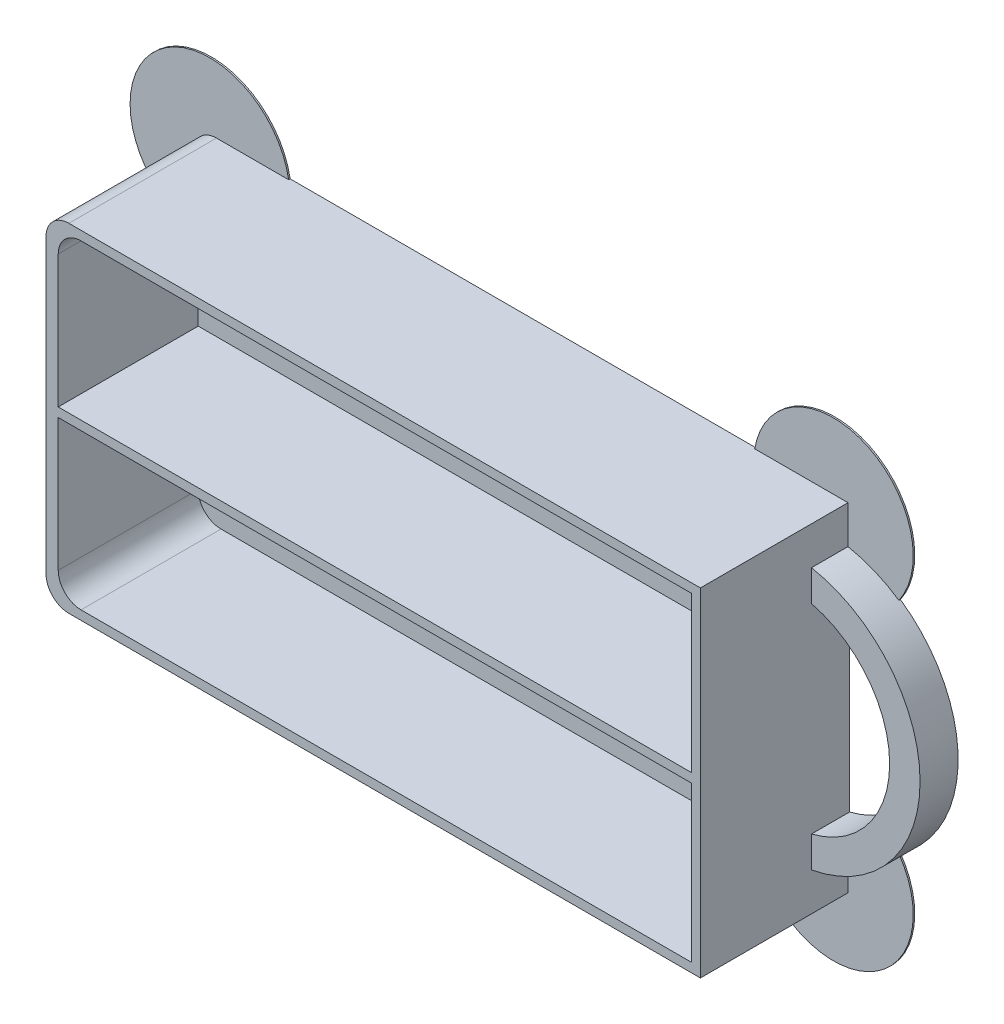
ISO-10303-21;
HEADER;
FILE_DESCRIPTION(('STEP AP214'),'2;1');
FILE_NAME('part.step','',(''),(''),'','','');
FILE_SCHEMA(('AUTOMOTIVE_DESIGN { 1 0 10303 214 1 1 1 1 }'));
ENDSEC;
DATA;
#1=APPLICATION_CONTEXT('core data for automotive mechanical design processes');
#2=APPLICATION_PROTOCOL_DEFINITION('international standard','automotive_design',2000,#1);
#3=PRODUCT_CONTEXT('',#1,'mechanical');
#4=PRODUCT('Part','Part','',(#3));
#5=PRODUCT_RELATED_PRODUCT_CATEGORY('part','',(#4));
#6=PRODUCT_DEFINITION_FORMATION('','',#4);
#7=PRODUCT_DEFINITION_CONTEXT('part definition',#1,'design');
#8=PRODUCT_DEFINITION('design','',#6,#7);
#9=PRODUCT_DEFINITION_SHAPE('','',#8);
#10=(LENGTH_UNIT() NAMED_UNIT(*) SI_UNIT(.MILLI.,.METRE.));
#11=(NAMED_UNIT(*) PLANE_ANGLE_UNIT() SI_UNIT($,.RADIAN.));
#12=(NAMED_UNIT(*) SI_UNIT($,.STERADIAN.) SOLID_ANGLE_UNIT());
#13=UNCERTAINTY_MEASURE_WITH_UNIT(LENGTH_MEASURE(1.E-05),#10,'distance_accuracy_value','');
#14=(GEOMETRIC_REPRESENTATION_CONTEXT(3) GLOBAL_UNCERTAINTY_ASSIGNED_CONTEXT((#13)) GLOBAL_UNIT_ASSIGNED_CONTEXT((#10,
#11,#12)) REPRESENTATION_CONTEXT('',''));
#15=CARTESIAN_POINT('',(0.,0.,0.));
#16=DIRECTION('',(0.,0.,1.));
#17=DIRECTION('',(1.,0.,0.));
#18=AXIS2_PLACEMENT_3D('',#15,#16,#17);
#19=CARTESIAN_POINT('',(-40.,-19.2,19.6));
#20=DIRECTION('',(0.,0.,-1.));
#21=DIRECTION('',(-1.,0.,0.));
#22=AXIS2_PLACEMENT_3D('',#19,#20,#21);
#23=CYLINDRICAL_SURFACE('',#22,3.);
#24=DIRECTION('',(0.,0.,-1.));
#25=VECTOR('',#24,1.);
#26=CARTESIAN_POINT('',(-43.,-19.2,19.6));
#27=LINE('',#26,#25);
#28=CARTESIAN_POINT('',(-43.,-19.2,0.199999999999999));
#29=VERTEX_POINT('',#28);
#30=CARTESIAN_POINT('',(-43.,-19.2,19.6));
#31=VERTEX_POINT('',#30);
#32=EDGE_CURVE('E408',#29,#31,#27,.F.);
#33=ORIENTED_EDGE('',*,*,#32,.F.);
#34=CARTESIAN_POINT('',(-40.,-19.2,0.199999999999999));
#35=DIRECTION('',(0.,0.,-1.));
#36=DIRECTION('',(-1.,0.,0.));
#37=AXIS2_PLACEMENT_3D('',#34,#35,#36);
#38=CIRCLE('',#37,3.);
#39=CARTESIAN_POINT('',(-40.,-22.2,0.199999999999999));
#40=VERTEX_POINT('',#39);
#41=EDGE_CURVE('E49',#29,#40,#38,.F.);
#42=ORIENTED_EDGE('',*,*,#41,.T.);
#43=DIRECTION('',(0.,0.,-1.));
#44=VECTOR('',#43,1.);
#45=CARTESIAN_POINT('',(-40.,-22.2,19.6));
#46=LINE('',#45,#44);
#47=CARTESIAN_POINT('',(-40.,-22.2,19.6));
#48=VERTEX_POINT('',#47);
#49=EDGE_CURVE('E419',#48,#40,#46,.T.);
#50=ORIENTED_EDGE('',*,*,#49,.F.);
#51=CARTESIAN_POINT('',(-40.,-19.2,19.6));
#52=DIRECTION('',(0.,0.,1.));
#53=DIRECTION('',(1.,0.,0.));
#54=AXIS2_PLACEMENT_3D('',#51,#52,#53);
#55=CIRCLE('',#54,3.);
#56=EDGE_CURVE('E415',#31,#48,#55,.T.);
#57=ORIENTED_EDGE('',*,*,#56,.F.);
#58=EDGE_LOOP('',(#33,#42,#50,#57));
#59=FACE_BOUND('',#58,.T.);
#60=ADVANCED_FACE('F41',(#59),#23,.T.);
#61=CARTESIAN_POINT('',(43.,22.2,19.6));
#62=DIRECTION('',(-1.,0.,0.));
#63=DIRECTION('',(0.,-1.,0.));
#64=AXIS2_PLACEMENT_3D('',#61,#62,#63);
#65=PLANE('',#64);
#66=DIRECTION('',(0.,0.,-1.));
#67=VECTOR('',#66,1.);
#68=CARTESIAN_POINT('',(43.,-22.2,19.6));
#69=LINE('',#68,#67);
#70=CARTESIAN_POINT('',(43.,-22.2,19.6));
#71=VERTEX_POINT('',#70);
#72=CARTESIAN_POINT('',(43.,-22.2,0.199999999999999));
#73=VERTEX_POINT('',#72);
#74=EDGE_CURVE('E395',#71,#73,#69,.T.);
#75=ORIENTED_EDGE('',*,*,#74,.T.);
#76=DIRECTION('',(0.,1.,0.));
#77=VECTOR('',#76,1.);
#78=CARTESIAN_POINT('',(43.,22.2,0.199999999999999));
#79=LINE('',#78,#77);
#80=CARTESIAN_POINT('',(43.,-17.2,0.2));
#81=VERTEX_POINT('',#80);
#82=EDGE_CURVE('E249',#73,#81,#79,.T.);
#83=ORIENTED_EDGE('',*,*,#82,.T.);
#84=DIRECTION('',(0.,0.,-1.));
#85=VECTOR('',#84,1.);
#86=CARTESIAN_POINT('',(43.,-17.2,5.));
#87=LINE('',#86,#85);
#88=CARTESIAN_POINT('',(43.,-17.2,5.));
#89=VERTEX_POINT('',#88);
#90=EDGE_CURVE('E368',#89,#81,#87,.T.);
#91=ORIENTED_EDGE('',*,*,#90,.F.);
#92=DIRECTION('',(0.,-1.,0.));
#93=VECTOR('',#92,1.);
#94=CARTESIAN_POINT('',(43.,-17.2,5.));
#95=LINE('',#94,#93);
#96=CARTESIAN_POINT('',(43.,-13.1087756865391,5.));
#97=VERTEX_POINT('',#96);
#98=EDGE_CURVE('E366',#97,#89,#95,.T.);
#99=ORIENTED_EDGE('',*,*,#98,.F.);
#100=DIRECTION('',(0.,0.,-1.));
#101=VECTOR('',#100,1.);
#102=CARTESIAN_POINT('',(43.,-13.1087756865391,5.));
#103=LINE('',#102,#101);
#104=CARTESIAN_POINT('',(43.,-13.1087756865391,0.));
#105=VERTEX_POINT('',#104);
#106=EDGE_CURVE('E373',#97,#105,#103,.T.);
#107=ORIENTED_EDGE('',*,*,#106,.T.);
#108=DIRECTION('',(0.,1.,0.));
#109=VECTOR('',#108,1.);
#110=CARTESIAN_POINT('',(43.,22.2,0.));
#111=LINE('',#110,#109);
#112=CARTESIAN_POINT('',(43.,13.1087756865391,0.));
#113=VERTEX_POINT('',#112);
#114=EDGE_CURVE('E382',#105,#113,#111,.T.);
#115=ORIENTED_EDGE('',*,*,#114,.T.);
#116=DIRECTION('',(0.,0.,-1.));
#117=VECTOR('',#116,1.);
#118=CARTESIAN_POINT('',(43.,13.1087756865391,5.));
#119=LINE('',#118,#117);
#120=CARTESIAN_POINT('',(43.,13.1087756865391,5.));
#121=VERTEX_POINT('',#120);
#122=EDGE_CURVE('E376',#121,#113,#119,.T.);
#123=ORIENTED_EDGE('',*,*,#122,.F.);
#124=DIRECTION('',(0.,-1.,0.));
#125=VECTOR('',#124,1.);
#126=CARTESIAN_POINT('',(43.,17.2,5.));
#127=LINE('',#126,#125);
#128=CARTESIAN_POINT('',(43.,17.2,5.));
#129=VERTEX_POINT('',#128);
#130=EDGE_CURVE('E360',#129,#121,#127,.T.);
#131=ORIENTED_EDGE('',*,*,#130,.F.);
#132=DIRECTION('',(0.,0.,-1.));
#133=VECTOR('',#132,1.);
#134=CARTESIAN_POINT('',(43.,17.2,5.));
#135=LINE('',#134,#133);
#136=CARTESIAN_POINT('',(43.,17.2,0.2));
#137=VERTEX_POINT('',#136);
#138=EDGE_CURVE('E379',#129,#137,#135,.T.);
#139=ORIENTED_EDGE('',*,*,#138,.T.);
#140=DIRECTION('',(0.,-1.,0.));
#141=VECTOR('',#140,1.);
#142=CARTESIAN_POINT('',(43.,22.2,0.199999999999999));
#143=LINE('',#142,#141);
#144=CARTESIAN_POINT('',(43.,22.2,0.199999999999999));
#145=VERTEX_POINT('',#144);
#146=EDGE_CURVE('E296',#145,#137,#143,.T.);
#147=ORIENTED_EDGE('',*,*,#146,.F.);
#148=DIRECTION('',(0.,0.,-1.));
#149=VECTOR('',#148,1.);
#150=CARTESIAN_POINT('',(43.,22.2,19.6));
#151=LINE('',#150,#149);
#152=CARTESIAN_POINT('',(43.,22.2,19.6));
#153=VERTEX_POINT('',#152);
#154=EDGE_CURVE('E405',#153,#145,#151,.T.);
#155=ORIENTED_EDGE('',*,*,#154,.F.);
#156=DIRECTION('',(0.,1.,0.));
#157=VECTOR('',#156,1.);
#158=CARTESIAN_POINT('',(43.,22.2,19.6));
#159=LINE('',#158,#157);
#160=EDGE_CURVE('E383',#71,#153,#159,.T.);
#161=ORIENTED_EDGE('',*,*,#160,.F.);
#162=EDGE_LOOP('',(#75,#83,#91,#99,#107,#115,#123,#131,#139,#147,#155,#161));
#163=FACE_BOUND('',#162,.T.);
#164=ADVANCED_FACE('F490',(#163),#65,.F.);
#165=CARTESIAN_POINT('',(-43.,22.2,19.6));
#166=DIRECTION('',(0.,-1.,0.));
#167=DIRECTION('',(0.,0.,-1.));
#168=AXIS2_PLACEMENT_3D('',#165,#166,#167);
#169=PLANE('',#168);
#170=DIRECTION('',(-1.,0.,0.));
#171=VECTOR('',#170,1.);
#172=CARTESIAN_POINT('',(-43.,22.2,0.));
#173=LINE('',#172,#171);
#174=CARTESIAN_POINT('',(30.736733343293,22.2,0.));
#175=VERTEX_POINT('',#174);
#176=CARTESIAN_POINT('',(-30.5170952229311,22.2,0.));
#177=VERTEX_POINT('',#176);
#178=EDGE_CURVE('E397',#175,#177,#173,.T.);
#179=ORIENTED_EDGE('',*,*,#178,.T.);
#180=DIRECTION('',(0.,0.,-1.));
#181=VECTOR('',#180,1.);
#182=CARTESIAN_POINT('',(-30.5170952229311,22.2,0.2));
#183=LINE('',#182,#181);
#184=CARTESIAN_POINT('',(-30.5170952229311,22.2,0.2));
#185=VERTEX_POINT('',#184);
#186=EDGE_CURVE('E273',#185,#177,#183,.T.);
#187=ORIENTED_EDGE('',*,*,#186,.F.);
#188=DIRECTION('',(-1.,0.,0.));
#189=VECTOR('',#188,1.);
#190=CARTESIAN_POINT('',(-43.,22.2,0.199999999999999));
#191=LINE('',#190,#189);
#192=CARTESIAN_POINT('',(-40.,22.2,0.199999999999999));
#193=VERTEX_POINT('',#192);
#194=EDGE_CURVE('E286',#185,#193,#191,.T.);
#195=ORIENTED_EDGE('',*,*,#194,.T.);
#196=DIRECTION('',(0.,0.,-1.));
#197=VECTOR('',#196,1.);
#198=CARTESIAN_POINT('',(-40.,22.2,19.6));
#199=LINE('',#198,#197);
#200=CARTESIAN_POINT('',(-40.,22.2,19.6));
#201=VERTEX_POINT('',#200);
#202=EDGE_CURVE('E413',#193,#201,#199,.F.);
#203=ORIENTED_EDGE('',*,*,#202,.T.);
#204=DIRECTION('',(-1.,0.,0.));
#205=VECTOR('',#204,1.);
#206=CARTESIAN_POINT('',(-43.,22.2,19.6));
#207=LINE('',#206,#205);
#208=EDGE_CURVE('E386',#153,#201,#207,.T.);
#209=ORIENTED_EDGE('',*,*,#208,.F.);
#210=ORIENTED_EDGE('',*,*,#154,.T.);
#211=DIRECTION('',(1.,0.,0.));
#212=VECTOR('',#211,1.);
#213=CARTESIAN_POINT('',(-43.,22.2,0.199999999999999));
#214=LINE('',#213,#212);
#215=CARTESIAN_POINT('',(30.7367333432933,22.2,0.199999999999999));
#216=VERTEX_POINT('',#215);
#217=EDGE_CURVE('E300',#216,#145,#214,.T.);
#218=ORIENTED_EDGE('',*,*,#217,.F.);
#219=DIRECTION('',(0.,0.,-1.));
#220=VECTOR('',#219,1.);
#221=CARTESIAN_POINT('',(30.7367333432933,22.2,0.2));
#222=LINE('',#221,#220);
#223=EDGE_CURVE('E294',#216,#175,#222,.T.);
#224=ORIENTED_EDGE('',*,*,#223,.T.);
#225=EDGE_LOOP('',(#179,#187,#195,#203,#209,#210,#218,#224));
#226=FACE_BOUND('',#225,.T.);
#227=ADVANCED_FACE('F472',(#226),#169,.F.);
#228=CARTESIAN_POINT('',(-43.,22.2,19.6));
#229=DIRECTION('',(1.,0.,0.));
#230=DIRECTION('',(0.,1.,0.));
#231=AXIS2_PLACEMENT_3D('',#228,#229,#230);
#232=PLANE('',#231);
#233=DIRECTION('',(0.,-1.,0.));
#234=VECTOR('',#233,1.);
#235=CARTESIAN_POINT('',(-43.,22.2,0.));
#236=LINE('',#235,#234);
#237=CARTESIAN_POINT('',(-43.,10.1447680585788,0.));
#238=VERTEX_POINT('',#237);
#239=CARTESIAN_POINT('',(-43.,-10.1447680585788,0.));
#240=VERTEX_POINT('',#239);
#241=EDGE_CURVE('E400',#238,#240,#236,.T.);
#242=ORIENTED_EDGE('',*,*,#241,.T.);
#243=DIRECTION('',(0.,0.,-1.));
#244=VECTOR('',#243,1.);
#245=CARTESIAN_POINT('',(-43.,-10.1447680585788,0.2));
#246=LINE('',#245,#244);
#247=CARTESIAN_POINT('',(-43.,-10.1447680585788,0.2));
#248=VERTEX_POINT('',#247);
#249=EDGE_CURVE('E258',#248,#240,#246,.T.);
#250=ORIENTED_EDGE('',*,*,#249,.F.);
#251=DIRECTION('',(0.,1.,0.));
#252=VECTOR('',#251,1.);
#253=CARTESIAN_POINT('',(-43.,22.2,0.199999999999999));
#254=LINE('',#253,#252);
#255=EDGE_CURVE('E270',#29,#248,#254,.T.);
#256=ORIENTED_EDGE('',*,*,#255,.F.);
#257=ORIENTED_EDGE('',*,*,#32,.T.);
#258=DIRECTION('',(0.,-1.,0.));
#259=VECTOR('',#258,1.);
#260=CARTESIAN_POINT('',(-43.,22.2,19.6));
#261=LINE('',#260,#259);
#262=CARTESIAN_POINT('',(-43.,19.2,19.6));
#263=VERTEX_POINT('',#262);
#264=EDGE_CURVE('E390',#263,#31,#261,.T.);
#265=ORIENTED_EDGE('',*,*,#264,.F.);
#266=DIRECTION('',(0.,0.,-1.));
#267=VECTOR('',#266,1.);
#268=CARTESIAN_POINT('',(-43.,19.2,19.6));
#269=LINE('',#268,#267);
#270=CARTESIAN_POINT('',(-43.,19.2,0.199999999999999));
#271=VERTEX_POINT('',#270);
#272=EDGE_CURVE('E410',#263,#271,#269,.T.);
#273=ORIENTED_EDGE('',*,*,#272,.T.);
#274=DIRECTION('',(0.,-1.,0.));
#275=VECTOR('',#274,1.);
#276=CARTESIAN_POINT('',(-43.,22.2,0.199999999999999));
#277=LINE('',#276,#275);
#278=CARTESIAN_POINT('',(-43.,10.1447680585788,0.2));
#279=VERTEX_POINT('',#278);
#280=EDGE_CURVE('E281',#271,#279,#277,.T.);
#281=ORIENTED_EDGE('',*,*,#280,.T.);
#282=DIRECTION('',(0.,0.,-1.));
#283=VECTOR('',#282,1.);
#284=CARTESIAN_POINT('',(-43.,10.1447680585788,0.2));
#285=LINE('',#284,#283);
#286=EDGE_CURVE('E272',#279,#238,#285,.T.);
#287=ORIENTED_EDGE('',*,*,#286,.T.);
#288=EDGE_LOOP('',(#242,#250,#256,#257,#265,#273,#281,#287));
#289=FACE_BOUND('',#288,.T.);
#290=ADVANCED_FACE('F462',(#289),#232,.F.);
#291=CARTESIAN_POINT('',(-43.,-22.2,19.6));
#292=DIRECTION('',(0.,1.,0.));
#293=DIRECTION('',(0.,0.,1.));
#294=AXIS2_PLACEMENT_3D('',#291,#292,#293);
#295=PLANE('',#294);
#296=DIRECTION('',(1.,0.,0.));
#297=VECTOR('',#296,1.);
#298=CARTESIAN_POINT('',(-43.,-22.2,0.));
#299=LINE('',#298,#297);
#300=CARTESIAN_POINT('',(-30.5170952229311,-22.2,0.));
#301=VERTEX_POINT('',#300);
#302=CARTESIAN_POINT('',(30.7367333432931,-22.2,0.));
#303=VERTEX_POINT('',#302);
#304=EDGE_CURVE('E387',#301,#303,#299,.T.);
#305=ORIENTED_EDGE('',*,*,#304,.T.);
#306=DIRECTION('',(0.,0.,-1.));
#307=VECTOR('',#306,1.);
#308=CARTESIAN_POINT('',(30.7367333432933,-22.2,0.2));
#309=LINE('',#308,#307);
#310=CARTESIAN_POINT('',(30.7367333432933,-22.2,0.199999999999999));
#311=VERTEX_POINT('',#310);
#312=EDGE_CURVE('E56',#311,#303,#309,.T.);
#313=ORIENTED_EDGE('',*,*,#312,.F.);
#314=DIRECTION('',(1.,0.,0.));
#315=VECTOR('',#314,1.);
#316=CARTESIAN_POINT('',(-43.,-22.2,0.199999999999999));
#317=LINE('',#316,#315);
#318=EDGE_CURVE('E60',#311,#73,#317,.T.);
#319=ORIENTED_EDGE('',*,*,#318,.T.);
#320=ORIENTED_EDGE('',*,*,#74,.F.);
#321=DIRECTION('',(1.,0.,0.));
#322=VECTOR('',#321,1.);
#323=CARTESIAN_POINT('',(-43.,-22.2,19.6));
#324=LINE('',#323,#322);
#325=EDGE_CURVE('E393',#48,#71,#324,.T.);
#326=ORIENTED_EDGE('',*,*,#325,.F.);
#327=ORIENTED_EDGE('',*,*,#49,.T.);
#328=DIRECTION('',(-1.,0.,0.));
#329=VECTOR('',#328,1.);
#330=CARTESIAN_POINT('',(-43.,-22.2,0.199999999999999));
#331=LINE('',#330,#329);
#332=CARTESIAN_POINT('',(-30.5170952229311,-22.2,0.2));
#333=VERTEX_POINT('',#332);
#334=EDGE_CURVE('E266',#333,#40,#331,.T.);
#335=ORIENTED_EDGE('',*,*,#334,.F.);
#336=DIRECTION('',(0.,0.,-1.));
#337=VECTOR('',#336,1.);
#338=CARTESIAN_POINT('',(-30.5170952229311,-22.2,0.2));
#339=LINE('',#338,#337);
#340=EDGE_CURVE('E257',#333,#301,#339,.T.);
#341=ORIENTED_EDGE('',*,*,#340,.T.);
#342=EDGE_LOOP('',(#305,#313,#319,#320,#326,#327,#335,#341));
#343=FACE_BOUND('',#342,.T.);
#344=ADVANCED_FACE('F453',(#343),#295,.F.);
#345=CARTESIAN_POINT('',(0.,0.,19.6));
#346=DIRECTION('',(0.,0.,1.));
#347=DIRECTION('',(1.,0.,0.));
#348=AXIS2_PLACEMENT_3D('',#345,#346,#347);
#349=PLANE('',#348);
#350=DIRECTION('',(-1.,0.,0.));
#351=VECTOR('',#350,1.);
#352=CARTESIAN_POINT('',(0.,21.,19.6));
#353=LINE('',#352,#351);
#354=CARTESIAN_POINT('',(41.8,21.,19.6));
#355=VERTEX_POINT('',#354);
#356=CARTESIAN_POINT('',(-38.4,21.,19.6));
#357=VERTEX_POINT('',#356);
#358=EDGE_CURVE('E312',#355,#357,#353,.T.);
#359=ORIENTED_EDGE('',*,*,#358,.F.);
#360=DIRECTION('',(0.,1.,0.));
#361=VECTOR('',#360,1.);
#362=CARTESIAN_POINT('',(41.8,0.,19.6));
#363=LINE('',#362,#361);
#364=CARTESIAN_POINT('',(41.8,0.597115384615389,19.6));
#365=VERTEX_POINT('',#364);
#366=EDGE_CURVE('E321',#365,#355,#363,.T.);
#367=ORIENTED_EDGE('',*,*,#366,.F.);
#368=DIRECTION('',(-1.,0.,0.));
#369=VECTOR('',#368,1.);
#370=CARTESIAN_POINT('',(0.,0.597115384615384,19.6));
#371=LINE('',#370,#369);
#372=CARTESIAN_POINT('',(-41.4,0.597115384615379,19.6));
#373=VERTEX_POINT('',#372);
#374=EDGE_CURVE('E318',#365,#373,#371,.T.);
#375=ORIENTED_EDGE('',*,*,#374,.T.);
#376=DIRECTION('',(0.,-1.,0.));
#377=VECTOR('',#376,1.);
#378=CARTESIAN_POINT('',(-41.4,0.,19.6));
#379=LINE('',#378,#377);
#380=CARTESIAN_POINT('',(-41.4,18.,19.6));
#381=VERTEX_POINT('',#380);
#382=EDGE_CURVE('E315',#381,#373,#379,.T.);
#383=ORIENTED_EDGE('',*,*,#382,.F.);
#384=CARTESIAN_POINT('',(-38.4,18.,19.6));
#385=DIRECTION('',(0.,0.,1.));
#386=DIRECTION('',(1.,0.,0.));
#387=AXIS2_PLACEMENT_3D('',#384,#385,#386);
#388=CIRCLE('',#387,3.);
#389=EDGE_CURVE('E438',#381,#357,#388,.F.);
#390=ORIENTED_EDGE('',*,*,#389,.T.);
#391=EDGE_LOOP('',(#359,#367,#375,#383,#390));
#392=FACE_BOUND('',#391,.T.);
#393=DIRECTION('',(-1.,0.,0.));
#394=VECTOR('',#393,1.);
#395=CARTESIAN_POINT('',(0.,-0.602884615384616,19.6));
#396=LINE('',#395,#394);
#397=CARTESIAN_POINT('',(41.8,-0.60288461538461,19.6));
#398=VERTEX_POINT('',#397);
#399=CARTESIAN_POINT('',(-41.4,-0.602884615384621,19.6));
#400=VERTEX_POINT('',#399);
#401=EDGE_CURVE('E303',#398,#400,#396,.T.);
#402=ORIENTED_EDGE('',*,*,#401,.F.);
#403=DIRECTION('',(0.,1.,0.));
#404=VECTOR('',#403,1.);
#405=CARTESIAN_POINT('',(41.8,0.,19.6));
#406=LINE('',#405,#404);
#407=CARTESIAN_POINT('',(41.8,-21.,19.6));
#408=VERTEX_POINT('',#407);
#409=EDGE_CURVE('E346',#408,#398,#406,.T.);
#410=ORIENTED_EDGE('',*,*,#409,.F.);
#411=DIRECTION('',(1.,0.,0.));
#412=VECTOR('',#411,1.);
#413=CARTESIAN_POINT('',(0.,-21.,19.6));
#414=LINE('',#413,#412);
#415=CARTESIAN_POINT('',(-38.4,-21.,19.6));
#416=VERTEX_POINT('',#415);
#417=EDGE_CURVE('E344',#416,#408,#414,.T.);
#418=ORIENTED_EDGE('',*,*,#417,.F.);
#419=CARTESIAN_POINT('',(-38.4,-18.,19.6));
#420=DIRECTION('',(0.,0.,1.));
#421=DIRECTION('',(1.,0.,0.));
#422=AXIS2_PLACEMENT_3D('',#419,#420,#421);
#423=CIRCLE('',#422,3.);
#424=CARTESIAN_POINT('',(-41.4,-18.,19.6));
#425=VERTEX_POINT('',#424);
#426=EDGE_CURVE('E436',#416,#425,#423,.F.);
#427=ORIENTED_EDGE('',*,*,#426,.T.);
#428=DIRECTION('',(0.,-1.,0.));
#429=VECTOR('',#428,1.);
#430=CARTESIAN_POINT('',(-41.4,0.,19.6));
#431=LINE('',#430,#429);
#432=EDGE_CURVE('E341',#400,#425,#431,.T.);
#433=ORIENTED_EDGE('',*,*,#432,.F.);
#434=EDGE_LOOP('',(#402,#410,#418,#427,#433));
#435=FACE_BOUND('',#434,.T.);
#436=ORIENTED_EDGE('',*,*,#208,.T.);
#437=CARTESIAN_POINT('',(-40.,19.2,19.6));
#438=DIRECTION('',(0.,0.,1.));
#439=DIRECTION('',(1.,0.,0.));
#440=AXIS2_PLACEMENT_3D('',#437,#438,#439);
#441=CIRCLE('',#440,3.);
#442=EDGE_CURVE('E417',#201,#263,#441,.T.);
#443=ORIENTED_EDGE('',*,*,#442,.T.);
#444=ORIENTED_EDGE('',*,*,#264,.T.);
#445=ORIENTED_EDGE('',*,*,#56,.T.);
#446=ORIENTED_EDGE('',*,*,#325,.T.);
#447=ORIENTED_EDGE('',*,*,#160,.T.);
#448=EDGE_LOOP('',(#436,#443,#444,#445,#446,#447));
#449=FACE_BOUND('',#448,.T.);
#450=ADVANCED_FACE('F456',(#392,#435,#449),#349,.T.);
#451=CARTESIAN_POINT('',(0.,0.,0.));
#452=DIRECTION('',(0.,0.,1.));
#453=DIRECTION('',(1.,0.,0.));
#454=AXIS2_PLACEMENT_3D('',#451,#452,#453);
#455=PLANE('',#454);
#456=CARTESIAN_POINT('',(39.7735468390197,0.,0.));
#457=DIRECTION('',(0.,0.,1.));
#458=DIRECTION('',(1.,0.,0.));
#459=AXIS2_PLACEMENT_3D('',#456,#457,#458);
#460=CIRCLE('',#459,17.5);
#461=CARTESIAN_POINT('',(49.6891077895446,-14.4198353331938,0.));
#462=VERTEX_POINT('',#461);
#463=CARTESIAN_POINT('',(49.6891077895446,14.4198353331938,0.));
#464=VERTEX_POINT('',#463);
#465=EDGE_CURVE('E224',#462,#464,#460,.T.);
#466=ORIENTED_EDGE('',*,*,#465,.F.);
#467=CARTESIAN_POINT('',(41.078288815513,-20.4179428554082,0.));
#468=DIRECTION('',(0.,0.,-1.));
#469=DIRECTION('',(1.,0.,0.));
#470=AXIS2_PLACEMENT_3D('',#467,#468,#469);
#471=CIRCLE('',#470,10.4939743306141);
#472=EDGE_CURVE('E230',#462,#303,#471,.T.);
#473=ORIENTED_EDGE('',*,*,#472,.T.);
#474=ORIENTED_EDGE('',*,*,#304,.F.);
#475=CARTESIAN_POINT('',(-40.8586506951508,-20.4179428554082,0.));
#476=DIRECTION('',(0.,0.,-1.));
#477=DIRECTION('',(-1.,0.,0.));
#478=AXIS2_PLACEMENT_3D('',#475,#476,#477);
#479=CIRCLE('',#478,10.4939743306142);
#480=EDGE_CURVE('E263',#301,#240,#479,.T.);
#481=ORIENTED_EDGE('',*,*,#480,.T.);
#482=ORIENTED_EDGE('',*,*,#241,.F.);
#483=CARTESIAN_POINT('',(-40.8586506951508,20.4179428554082,0.));
#484=DIRECTION('',(0.,0.,-1.));
#485=DIRECTION('',(1.,0.,0.));
#486=AXIS2_PLACEMENT_3D('',#483,#484,#485);
#487=CIRCLE('',#486,10.4939743306142);
#488=EDGE_CURVE('E278',#238,#177,#487,.T.);
#489=ORIENTED_EDGE('',*,*,#488,.T.);
#490=ORIENTED_EDGE('',*,*,#178,.F.);
#491=CARTESIAN_POINT('',(41.078288815513,20.4179428554082,0.));
#492=DIRECTION('',(0.,0.,-1.));
#493=DIRECTION('',(-1.,0.,0.));
#494=AXIS2_PLACEMENT_3D('',#491,#492,#493);
#495=CIRCLE('',#494,10.4939743306141);
#496=EDGE_CURVE('E233',#175,#464,#495,.T.);
#497=ORIENTED_EDGE('',*,*,#496,.T.);
#498=EDGE_LOOP('',(#466,#473,#474,#481,#482,#489,#490,#497));
#499=FACE_BOUND('',#498,.T.);
#500=CARTESIAN_POINT('',(39.7735468390197,0.,0.));
#501=DIRECTION('',(0.,0.,-1.));
#502=DIRECTION('',(1.,0.,0.));
#503=AXIS2_PLACEMENT_3D('',#500,#501,#502);
#504=CIRCLE('',#503,13.5);
#505=EDGE_CURVE('E236',#113,#105,#504,.T.);
#506=ORIENTED_EDGE('',*,*,#505,.F.);
#507=ORIENTED_EDGE('',*,*,#114,.F.);
#508=EDGE_LOOP('',(#506,#507));
#509=FACE_BOUND('',#508,.T.);
#510=ADVANCED_FACE('F226',(#499,#509),#455,.F.);
#511=CARTESIAN_POINT('',(39.7735468390197,0.,5.));
#512=DIRECTION('',(0.,0.,-1.));
#513=DIRECTION('',(-1.,0.,0.));
#514=AXIS2_PLACEMENT_3D('',#511,#512,#513);
#515=CYLINDRICAL_SURFACE('',#514,17.5);
#516=CARTESIAN_POINT('',(39.7735468390197,0.,0.2));
#517=DIRECTION('',(0.,0.,1.));
#518=DIRECTION('',(1.,0.,0.));
#519=AXIS2_PLACEMENT_3D('',#516,#517,#518);
#520=CIRCLE('',#519,17.5);
#521=CARTESIAN_POINT('',(49.6891077895446,-14.4198353331938,0.2));
#522=VERTEX_POINT('',#521);
#523=EDGE_CURVE('E12',#81,#522,#520,.T.);
#524=ORIENTED_EDGE('',*,*,#523,.T.);
#525=DIRECTION('',(0.,0.,-1.));
#526=VECTOR('',#525,1.);
#527=CARTESIAN_POINT('',(49.6891077895446,-14.4198353331938,0.2));
#528=LINE('',#527,#526);
#529=EDGE_CURVE('E240',#522,#462,#528,.T.);
#530=ORIENTED_EDGE('',*,*,#529,.T.);
#531=ORIENTED_EDGE('',*,*,#465,.T.);
#532=DIRECTION('',(0.,0.,-1.));
#533=VECTOR('',#532,1.);
#534=CARTESIAN_POINT('',(49.6891077895446,14.4198353331938,0.2));
#535=LINE('',#534,#533);
#536=CARTESIAN_POINT('',(49.6891077895446,14.4198353331938,0.2));
#537=VERTEX_POINT('',#536);
#538=EDGE_CURVE('E292',#537,#464,#535,.T.);
#539=ORIENTED_EDGE('',*,*,#538,.F.);
#540=CARTESIAN_POINT('',(39.7735468390197,0.,0.2));
#541=DIRECTION('',(0.,0.,-1.));
#542=DIRECTION('',(-1.,0.,0.));
#543=AXIS2_PLACEMENT_3D('',#540,#541,#542);
#544=CIRCLE('',#543,17.5);
#545=EDGE_CURVE('E440',#137,#537,#544,.T.);
#546=ORIENTED_EDGE('',*,*,#545,.F.);
#547=ORIENTED_EDGE('',*,*,#138,.F.);
#548=CARTESIAN_POINT('',(39.7735468390197,0.,5.));
#549=DIRECTION('',(0.,0.,1.));
#550=DIRECTION('',(1.,0.,0.));
#551=AXIS2_PLACEMENT_3D('',#548,#549,#550);
#552=CIRCLE('',#551,17.5);
#553=EDGE_CURVE('E357',#89,#129,#552,.T.);
#554=ORIENTED_EDGE('',*,*,#553,.F.);
#555=ORIENTED_EDGE('',*,*,#90,.T.);
#556=EDGE_LOOP('',(#524,#530,#531,#539,#546,#547,#554,#555));
#557=FACE_BOUND('',#556,.T.);
#558=ADVANCED_FACE('F241',(#557),#515,.T.);
#559=CARTESIAN_POINT('',(39.7735468390197,0.,5.));
#560=DIRECTION('',(0.,0.,-1.));
#561=DIRECTION('',(-1.,0.,0.));
#562=AXIS2_PLACEMENT_3D('',#559,#560,#561);
#563=CYLINDRICAL_SURFACE('',#562,13.5);
#564=ORIENTED_EDGE('',*,*,#505,.T.);
#565=ORIENTED_EDGE('',*,*,#106,.F.);
#566=CARTESIAN_POINT('',(39.7735468390197,0.,5.));
#567=DIRECTION('',(0.,0.,-1.));
#568=DIRECTION('',(1.,0.,0.));
#569=AXIS2_PLACEMENT_3D('',#566,#567,#568);
#570=CIRCLE('',#569,13.5);
#571=EDGE_CURVE('E363',#121,#97,#570,.T.);
#572=ORIENTED_EDGE('',*,*,#571,.F.);
#573=ORIENTED_EDGE('',*,*,#122,.T.);
#574=EDGE_LOOP('',(#564,#565,#572,#573));
#575=FACE_BOUND('',#574,.T.);
#576=ADVANCED_FACE('F549',(#575),#563,.F.);
#577=CARTESIAN_POINT('',(39.7735468390197,0.,5.));
#578=DIRECTION('',(0.,0.,1.));
#579=DIRECTION('',(1.,0.,0.));
#580=AXIS2_PLACEMENT_3D('',#577,#578,#579);
#581=PLANE('',#580);
#582=ORIENTED_EDGE('',*,*,#553,.T.);
#583=ORIENTED_EDGE('',*,*,#130,.T.);
#584=ORIENTED_EDGE('',*,*,#571,.T.);
#585=ORIENTED_EDGE('',*,*,#98,.T.);
#586=EDGE_LOOP('',(#582,#583,#584,#585));
#587=FACE_BOUND('',#586,.T.);
#588=ADVANCED_FACE('F546',(#587),#581,.T.);
#589=CARTESIAN_POINT('',(0.,-0.602884615384616,-85.6651486932037));
#590=DIRECTION('',(0.,1.,0.));
#591=DIRECTION('',(-1.,0.,0.));
#592=AXIS2_PLACEMENT_3D('',#589,#590,#591);
#593=PLANE('',#592);
#594=DIRECTION('',(1.,0.,0.));
#595=VECTOR('',#594,1.);
#596=CARTESIAN_POINT('',(0.,-0.602884615384616,1.20000000000001));
#597=LINE('',#596,#595);
#598=CARTESIAN_POINT('',(-41.4,-0.602884615384621,1.20000000000001));
#599=VERTEX_POINT('',#598);
#600=CARTESIAN_POINT('',(41.8,-0.60288461538461,1.20000000000001));
#601=VERTEX_POINT('',#600);
#602=EDGE_CURVE('E338',#599,#601,#597,.T.);
#603=ORIENTED_EDGE('',*,*,#602,.T.);
#604=DIRECTION('',(0.,0.,1.));
#605=VECTOR('',#604,1.);
#606=CARTESIAN_POINT('',(41.8,-0.60288461538461,-85.6651486932037));
#607=LINE('',#606,#605);
#608=EDGE_CURVE('E336',#601,#398,#607,.T.);
#609=ORIENTED_EDGE('',*,*,#608,.T.);
#610=ORIENTED_EDGE('',*,*,#401,.T.);
#611=DIRECTION('',(0.,0.,1.));
#612=VECTOR('',#611,1.);
#613=CARTESIAN_POINT('',(-41.4,-0.602884615384621,-85.6651486932037));
#614=LINE('',#613,#612);
#615=EDGE_CURVE('E349',#599,#400,#614,.T.);
#616=ORIENTED_EDGE('',*,*,#615,.F.);
#617=EDGE_LOOP('',(#603,#609,#610,#616));
#618=FACE_BOUND('',#617,.T.);
#619=ADVANCED_FACE('F530',(#618),#593,.F.);
#620=CARTESIAN_POINT('',(41.8,0.,-85.6651486932037));
#621=DIRECTION('',(1.,0.,0.));
#622=DIRECTION('',(0.,1.,0.));
#623=AXIS2_PLACEMENT_3D('',#620,#621,#622);
#624=PLANE('',#623);
#625=DIRECTION('',(0.,-1.,0.));
#626=VECTOR('',#625,1.);
#627=CARTESIAN_POINT('',(41.8,0.,1.20000000000001));
#628=LINE('',#627,#626);
#629=CARTESIAN_POINT('',(41.8,-21.,1.20000000000001));
#630=VERTEX_POINT('',#629);
#631=EDGE_CURVE('E335',#601,#630,#628,.T.);
#632=ORIENTED_EDGE('',*,*,#631,.T.);
#633=DIRECTION('',(0.,0.,1.));
#634=VECTOR('',#633,1.);
#635=CARTESIAN_POINT('',(41.8,-21.,-85.6651486932037));
#636=LINE('',#635,#634);
#637=EDGE_CURVE('E351',#630,#408,#636,.T.);
#638=ORIENTED_EDGE('',*,*,#637,.T.);
#639=ORIENTED_EDGE('',*,*,#409,.T.);
#640=ORIENTED_EDGE('',*,*,#608,.F.);
#641=EDGE_LOOP('',(#632,#638,#639,#640));
#642=FACE_BOUND('',#641,.T.);
#643=ADVANCED_FACE('F523',(#642),#624,.F.);
#644=CARTESIAN_POINT('',(0.,-21.,-85.6651486932037));
#645=DIRECTION('',(0.,-1.,0.));
#646=DIRECTION('',(0.,0.,-1.));
#647=AXIS2_PLACEMENT_3D('',#644,#645,#646);
#648=PLANE('',#647);
#649=DIRECTION('',(-1.,0.,0.));
#650=VECTOR('',#649,1.);
#651=CARTESIAN_POINT('',(0.,-21.,1.20000000000001));
#652=LINE('',#651,#650);
#653=CARTESIAN_POINT('',(-38.4,-21.,1.20000000000001));
#654=VERTEX_POINT('',#653);
#655=EDGE_CURVE('E332',#630,#654,#652,.T.);
#656=ORIENTED_EDGE('',*,*,#655,.T.);
#657=DIRECTION('',(0.,0.,1.));
#658=VECTOR('',#657,1.);
#659=CARTESIAN_POINT('',(-38.4,-21.,19.6));
#660=LINE('',#659,#658);
#661=EDGE_CURVE('E422',#654,#416,#660,.T.);
#662=ORIENTED_EDGE('',*,*,#661,.T.);
#663=ORIENTED_EDGE('',*,*,#417,.T.);
#664=ORIENTED_EDGE('',*,*,#637,.F.);
#665=EDGE_LOOP('',(#656,#662,#663,#664));
#666=FACE_BOUND('',#665,.T.);
#667=ADVANCED_FACE('F519',(#666),#648,.F.);
#668=CARTESIAN_POINT('',(-41.4,0.,-85.6651486932037));
#669=DIRECTION('',(-1.,0.,0.));
#670=DIRECTION('',(0.,-1.,0.));
#671=AXIS2_PLACEMENT_3D('',#668,#669,#670);
#672=PLANE('',#671);
#673=ORIENTED_EDGE('',*,*,#432,.T.);
#674=DIRECTION('',(0.,0.,1.));
#675=VECTOR('',#674,1.);
#676=CARTESIAN_POINT('',(-41.4,-18.,1.20000000000001));
#677=LINE('',#676,#675);
#678=CARTESIAN_POINT('',(-41.4,-18.,1.20000000000001));
#679=VERTEX_POINT('',#678);
#680=EDGE_CURVE('E425',#425,#679,#677,.F.);
#681=ORIENTED_EDGE('',*,*,#680,.T.);
#682=DIRECTION('',(0.,1.,0.));
#683=VECTOR('',#682,1.);
#684=CARTESIAN_POINT('',(-41.4,0.,1.20000000000001));
#685=LINE('',#684,#683);
#686=EDGE_CURVE('E316',#679,#599,#685,.T.);
#687=ORIENTED_EDGE('',*,*,#686,.T.);
#688=ORIENTED_EDGE('',*,*,#615,.T.);
#689=EDGE_LOOP('',(#673,#681,#687,#688));
#690=FACE_BOUND('',#689,.T.);
#691=ADVANCED_FACE('F532',(#690),#672,.F.);
#692=CARTESIAN_POINT('',(0.,0.,1.2));
#693=DIRECTION('',(0.,0.,1.));
#694=DIRECTION('',(1.,0.,0.));
#695=AXIS2_PLACEMENT_3D('',#692,#693,#694);
#696=PLANE('',#695);
#697=ORIENTED_EDGE('',*,*,#686,.F.);
#698=CARTESIAN_POINT('',(-38.4,-18.,1.20000000000001));
#699=DIRECTION('',(0.,0.,1.));
#700=DIRECTION('',(1.,0.,0.));
#701=AXIS2_PLACEMENT_3D('',#698,#699,#700);
#702=CIRCLE('',#701,3.);
#703=EDGE_CURVE('E427',#679,#654,#702,.T.);
#704=ORIENTED_EDGE('',*,*,#703,.T.);
#705=ORIENTED_EDGE('',*,*,#655,.F.);
#706=ORIENTED_EDGE('',*,*,#631,.F.);
#707=ORIENTED_EDGE('',*,*,#602,.F.);
#708=EDGE_LOOP('',(#697,#704,#705,#706,#707));
#709=FACE_BOUND('',#708,.T.);
#710=ADVANCED_FACE('F514',(#709),#696,.T.);
#711=CARTESIAN_POINT('',(0.,21.,-85.6651486932037));
#712=DIRECTION('',(0.,1.,0.));
#713=DIRECTION('',(0.,0.,1.));
#714=AXIS2_PLACEMENT_3D('',#711,#712,#713);
#715=PLANE('',#714);
#716=ORIENTED_EDGE('',*,*,#358,.T.);
#717=DIRECTION('',(0.,0.,1.));
#718=VECTOR('',#717,1.);
#719=CARTESIAN_POINT('',(-38.4,21.,1.20000000000001));
#720=LINE('',#719,#718);
#721=CARTESIAN_POINT('',(-38.4,21.,1.20000000000001));
#722=VERTEX_POINT('',#721);
#723=EDGE_CURVE('E432',#357,#722,#720,.F.);
#724=ORIENTED_EDGE('',*,*,#723,.T.);
#725=DIRECTION('',(1.,0.,0.));
#726=VECTOR('',#725,1.);
#727=CARTESIAN_POINT('',(0.,21.,1.20000000000001));
#728=LINE('',#727,#726);
#729=CARTESIAN_POINT('',(41.8,21.,1.20000000000001));
#730=VERTEX_POINT('',#729);
#731=EDGE_CURVE('E310',#722,#730,#728,.T.);
#732=ORIENTED_EDGE('',*,*,#731,.T.);
#733=DIRECTION('',(0.,0.,1.));
#734=VECTOR('',#733,1.);
#735=CARTESIAN_POINT('',(41.8,21.,-85.6651486932037));
#736=LINE('',#735,#734);
#737=EDGE_CURVE('E308',#730,#355,#736,.T.);
#738=ORIENTED_EDGE('',*,*,#737,.T.);
#739=EDGE_LOOP('',(#716,#724,#732,#738));
#740=FACE_BOUND('',#739,.T.);
#741=ADVANCED_FACE('F539',(#740),#715,.F.);
#742=CARTESIAN_POINT('',(41.8,0.,-85.6651486932037));
#743=DIRECTION('',(1.,0.,0.));
#744=DIRECTION('',(0.,1.,0.));
#745=AXIS2_PLACEMENT_3D('',#742,#743,#744);
#746=PLANE('',#745);
#747=DIRECTION('',(0.,-1.,0.));
#748=VECTOR('',#747,1.);
#749=CARTESIAN_POINT('',(41.8,0.,1.20000000000001));
#750=LINE('',#749,#748);
#751=CARTESIAN_POINT('',(41.8,0.597115384615389,1.20000000000001));
#752=VERTEX_POINT('',#751);
#753=EDGE_CURVE('E307',#730,#752,#750,.T.);
#754=ORIENTED_EDGE('',*,*,#753,.T.);
#755=DIRECTION('',(0.,0.,1.));
#756=VECTOR('',#755,1.);
#757=CARTESIAN_POINT('',(41.8,0.597115384615389,-85.6651486932037));
#758=LINE('',#757,#756);
#759=EDGE_CURVE('E326',#752,#365,#758,.T.);
#760=ORIENTED_EDGE('',*,*,#759,.T.);
#761=ORIENTED_EDGE('',*,*,#366,.T.);
#762=ORIENTED_EDGE('',*,*,#737,.F.);
#763=EDGE_LOOP('',(#754,#760,#761,#762));
#764=FACE_BOUND('',#763,.T.);
#765=ADVANCED_FACE('F636',(#764),#746,.F.);
#766=CARTESIAN_POINT('',(0.,0.597115384615384,-85.6651486932037));
#767=DIRECTION('',(0.,1.,0.));
#768=DIRECTION('',(-1.,0.,0.));
#769=AXIS2_PLACEMENT_3D('',#766,#767,#768);
#770=PLANE('',#769);
#771=DIRECTION('',(0.,0.,1.));
#772=VECTOR('',#771,1.);
#773=CARTESIAN_POINT('',(-41.4,0.597115384615379,-85.6651486932037));
#774=LINE('',#773,#772);
#775=CARTESIAN_POINT('',(-41.4,0.597115384615379,1.20000000000001));
#776=VERTEX_POINT('',#775);
#777=EDGE_CURVE('E324',#776,#373,#774,.T.);
#778=ORIENTED_EDGE('',*,*,#777,.T.);
#779=ORIENTED_EDGE('',*,*,#374,.F.);
#780=ORIENTED_EDGE('',*,*,#759,.F.);
#781=DIRECTION('',(1.,0.,0.));
#782=VECTOR('',#781,1.);
#783=CARTESIAN_POINT('',(0.,0.597115384615384,1.20000000000001));
#784=LINE('',#783,#782);
#785=EDGE_CURVE('E304',#776,#752,#784,.T.);
#786=ORIENTED_EDGE('',*,*,#785,.F.);
#787=EDGE_LOOP('',(#778,#779,#780,#786));
#788=FACE_BOUND('',#787,.T.);
#789=ADVANCED_FACE('F650',(#788),#770,.T.);
#790=CARTESIAN_POINT('',(-41.4,0.,-85.6651486932037));
#791=DIRECTION('',(-1.,0.,0.));
#792=DIRECTION('',(0.,-1.,0.));
#793=AXIS2_PLACEMENT_3D('',#790,#791,#792);
#794=PLANE('',#793);
#795=DIRECTION('',(0.,1.,0.));
#796=VECTOR('',#795,1.);
#797=CARTESIAN_POINT('',(-41.4,0.,1.20000000000001));
#798=LINE('',#797,#796);
#799=CARTESIAN_POINT('',(-41.4,18.,1.20000000000001));
#800=VERTEX_POINT('',#799);
#801=EDGE_CURVE('E237',#776,#800,#798,.T.);
#802=ORIENTED_EDGE('',*,*,#801,.T.);
#803=DIRECTION('',(0.,0.,1.));
#804=VECTOR('',#803,1.);
#805=CARTESIAN_POINT('',(-41.4,18.,19.6));
#806=LINE('',#805,#804);
#807=EDGE_CURVE('E429',#800,#381,#806,.T.);
#808=ORIENTED_EDGE('',*,*,#807,.T.);
#809=ORIENTED_EDGE('',*,*,#382,.T.);
#810=ORIENTED_EDGE('',*,*,#777,.F.);
#811=EDGE_LOOP('',(#802,#808,#809,#810));
#812=FACE_BOUND('',#811,.T.);
#813=ADVANCED_FACE('F645',(#812),#794,.F.);
#814=CARTESIAN_POINT('',(0.,0.,1.2));
#815=DIRECTION('',(0.,0.,1.));
#816=DIRECTION('',(1.,0.,0.));
#817=AXIS2_PLACEMENT_3D('',#814,#815,#816);
#818=PLANE('',#817);
#819=ORIENTED_EDGE('',*,*,#731,.F.);
#820=CARTESIAN_POINT('',(-38.4,18.,1.20000000000001));
#821=DIRECTION('',(0.,0.,1.));
#822=DIRECTION('',(1.,0.,0.));
#823=AXIS2_PLACEMENT_3D('',#820,#821,#822);
#824=CIRCLE('',#823,3.);
#825=EDGE_CURVE('E434',#722,#800,#824,.T.);
#826=ORIENTED_EDGE('',*,*,#825,.T.);
#827=ORIENTED_EDGE('',*,*,#801,.F.);
#828=ORIENTED_EDGE('',*,*,#785,.T.);
#829=ORIENTED_EDGE('',*,*,#753,.F.);
#830=EDGE_LOOP('',(#819,#826,#827,#828,#829));
#831=FACE_BOUND('',#830,.T.);
#832=ADVANCED_FACE('F507',(#831),#818,.T.);
#833=CARTESIAN_POINT('',(-40.,19.2,19.6));
#834=DIRECTION('',(0.,0.,-1.));
#835=DIRECTION('',(-1.,0.,0.));
#836=AXIS2_PLACEMENT_3D('',#833,#834,#835);
#837=CYLINDRICAL_SURFACE('',#836,3.);
#838=CARTESIAN_POINT('',(-40.,19.2,0.199999999999999));
#839=DIRECTION('',(0.,0.,1.));
#840=DIRECTION('',(1.,0.,0.));
#841=AXIS2_PLACEMENT_3D('',#838,#839,#840);
#842=CIRCLE('',#841,3.);
#843=EDGE_CURVE('E443',#271,#193,#842,.F.);
#844=ORIENTED_EDGE('',*,*,#843,.F.);
#845=ORIENTED_EDGE('',*,*,#272,.F.);
#846=ORIENTED_EDGE('',*,*,#442,.F.);
#847=ORIENTED_EDGE('',*,*,#202,.F.);
#848=EDGE_LOOP('',(#844,#845,#846,#847));
#849=FACE_BOUND('',#848,.T.);
#850=ADVANCED_FACE('F465',(#849),#837,.T.);
#851=CARTESIAN_POINT('',(-38.4,-18.,-85.6651486932037));
#852=DIRECTION('',(0.,0.,-1.));
#853=DIRECTION('',(-1.,0.,0.));
#854=AXIS2_PLACEMENT_3D('',#851,#852,#853);
#855=CYLINDRICAL_SURFACE('',#854,3.);
#856=ORIENTED_EDGE('',*,*,#703,.F.);
#857=ORIENTED_EDGE('',*,*,#680,.F.);
#858=ORIENTED_EDGE('',*,*,#426,.F.);
#859=ORIENTED_EDGE('',*,*,#661,.F.);
#860=EDGE_LOOP('',(#856,#857,#858,#859));
#861=FACE_BOUND('',#860,.T.);
#862=ADVANCED_FACE('F498',(#861),#855,.F.);
#863=CARTESIAN_POINT('',(-38.4,18.,-85.6651486932037));
#864=DIRECTION('',(0.,0.,-1.));
#865=DIRECTION('',(-1.,0.,0.));
#866=AXIS2_PLACEMENT_3D('',#863,#864,#865);
#867=CYLINDRICAL_SURFACE('',#866,3.);
#868=ORIENTED_EDGE('',*,*,#825,.F.);
#869=ORIENTED_EDGE('',*,*,#723,.F.);
#870=ORIENTED_EDGE('',*,*,#389,.F.);
#871=ORIENTED_EDGE('',*,*,#807,.F.);
#872=EDGE_LOOP('',(#868,#869,#870,#871));
#873=FACE_BOUND('',#872,.T.);
#874=ADVANCED_FACE('F43',(#873),#867,.F.);
#875=CARTESIAN_POINT('',(41.078288815513,20.4179428554082,0.2));
#876=DIRECTION('',(0.,0.,-1.));
#877=DIRECTION('',(-1.,0.,0.));
#878=AXIS2_PLACEMENT_3D('',#875,#876,#877);
#879=CYLINDRICAL_SURFACE('',#878,10.4939743306141);
#880=ORIENTED_EDGE('',*,*,#496,.F.);
#881=ORIENTED_EDGE('',*,*,#223,.F.);
#882=CARTESIAN_POINT('',(41.078288815513,20.4179428554082,0.2));
#883=DIRECTION('',(0.,0.,-1.));
#884=DIRECTION('',(-1.,0.,0.));
#885=AXIS2_PLACEMENT_3D('',#882,#883,#884);
#886=CIRCLE('',#885,10.4939743306141);
#887=EDGE_CURVE('E289',#216,#537,#886,.T.);
#888=ORIENTED_EDGE('',*,*,#887,.T.);
#889=ORIENTED_EDGE('',*,*,#538,.T.);
#890=EDGE_LOOP('',(#880,#881,#888,#889));
#891=FACE_BOUND('',#890,.T.);
#892=ADVANCED_FACE('F505',(#891),#879,.T.);
#893=CARTESIAN_POINT('',(41.078288815513,20.4179428554082,0.2));
#894=DIRECTION('',(0.,0.,-1.));
#895=DIRECTION('',(-1.,0.,0.));
#896=AXIS2_PLACEMENT_3D('',#893,#894,#895);
#897=PLANE('',#896);
#898=ORIENTED_EDGE('',*,*,#887,.F.);
#899=ORIENTED_EDGE('',*,*,#217,.T.);
#900=ORIENTED_EDGE('',*,*,#146,.T.);
#901=ORIENTED_EDGE('',*,*,#545,.T.);
#902=EDGE_LOOP('',(#898,#899,#900,#901));
#903=FACE_BOUND('',#902,.T.);
#904=ADVANCED_FACE('F779',(#903),#897,.F.);
#905=CARTESIAN_POINT('',(-40.8586506951508,20.4179428554082,0.2));
#906=DIRECTION('',(0.,0.,1.));
#907=DIRECTION('',(1.,0.,0.));
#908=AXIS2_PLACEMENT_3D('',#905,#906,#907);
#909=PLANE('',#908);
#910=ORIENTED_EDGE('',*,*,#194,.F.);
#911=CARTESIAN_POINT('',(-40.8586506951508,20.4179428554082,0.2));
#912=DIRECTION('',(0.,0.,-1.));
#913=DIRECTION('',(1.,0.,0.));
#914=AXIS2_PLACEMENT_3D('',#911,#912,#913);
#915=CIRCLE('',#914,10.4939743306142);
#916=EDGE_CURVE('E275',#279,#185,#915,.T.);
#917=ORIENTED_EDGE('',*,*,#916,.F.);
#918=ORIENTED_EDGE('',*,*,#280,.F.);
#919=ORIENTED_EDGE('',*,*,#843,.T.);
#920=EDGE_LOOP('',(#910,#917,#918,#919));
#921=FACE_BOUND('',#920,.T.);
#922=ADVANCED_FACE('F468',(#921),#909,.T.);
#923=CARTESIAN_POINT('',(-40.8586506951508,20.4179428554082,0.2));
#924=DIRECTION('',(0.,0.,-1.));
#925=DIRECTION('',(-1.,0.,0.));
#926=AXIS2_PLACEMENT_3D('',#923,#924,#925);
#927=CYLINDRICAL_SURFACE('',#926,10.4939743306142);
#928=ORIENTED_EDGE('',*,*,#488,.F.);
#929=ORIENTED_EDGE('',*,*,#286,.F.);
#930=ORIENTED_EDGE('',*,*,#916,.T.);
#931=ORIENTED_EDGE('',*,*,#186,.T.);
#932=EDGE_LOOP('',(#928,#929,#930,#931));
#933=FACE_BOUND('',#932,.T.);
#934=ADVANCED_FACE('F474',(#933),#927,.T.);
#935=CARTESIAN_POINT('',(-40.8586506951508,-20.4179428554082,0.2));
#936=DIRECTION('',(0.,0.,-1.));
#937=DIRECTION('',(-1.,0.,0.));
#938=AXIS2_PLACEMENT_3D('',#935,#936,#937);
#939=PLANE('',#938);
#940=ORIENTED_EDGE('',*,*,#41,.F.);
#941=ORIENTED_EDGE('',*,*,#255,.T.);
#942=CARTESIAN_POINT('',(-40.8586506951508,-20.4179428554082,0.2));
#943=DIRECTION('',(0.,0.,-1.));
#944=DIRECTION('',(-1.,0.,0.));
#945=AXIS2_PLACEMENT_3D('',#942,#943,#944);
#946=CIRCLE('',#945,10.4939743306142);
#947=EDGE_CURVE('E260',#333,#248,#946,.T.);
#948=ORIENTED_EDGE('',*,*,#947,.F.);
#949=ORIENTED_EDGE('',*,*,#334,.T.);
#950=EDGE_LOOP('',(#940,#941,#948,#949));
#951=FACE_BOUND('',#950,.T.);
#952=ADVANCED_FACE('F480',(#951),#939,.F.);
#953=CARTESIAN_POINT('',(-40.8586506951508,-20.4179428554082,0.2));
#954=DIRECTION('',(0.,0.,-1.));
#955=DIRECTION('',(-1.,0.,0.));
#956=AXIS2_PLACEMENT_3D('',#953,#954,#955);
#957=CYLINDRICAL_SURFACE('',#956,10.4939743306142);
#958=ORIENTED_EDGE('',*,*,#480,.F.);
#959=ORIENTED_EDGE('',*,*,#340,.F.);
#960=ORIENTED_EDGE('',*,*,#947,.T.);
#961=ORIENTED_EDGE('',*,*,#249,.T.);
#962=EDGE_LOOP('',(#958,#959,#960,#961));
#963=FACE_BOUND('',#962,.T.);
#964=ADVANCED_FACE('F478',(#963),#957,.T.);
#965=CARTESIAN_POINT('',(41.078288815513,-20.4179428554082,0.2));
#966=DIRECTION('',(0.,0.,-1.));
#967=DIRECTION('',(-1.,0.,0.));
#968=AXIS2_PLACEMENT_3D('',#965,#966,#967);
#969=CYLINDRICAL_SURFACE('',#968,10.4939743306141);
#970=ORIENTED_EDGE('',*,*,#472,.F.);
#971=ORIENTED_EDGE('',*,*,#529,.F.);
#972=CARTESIAN_POINT('',(41.078288815513,-20.4179428554082,0.2));
#973=DIRECTION('',(0.,0.,-1.));
#974=DIRECTION('',(1.,0.,0.));
#975=AXIS2_PLACEMENT_3D('',#972,#973,#974);
#976=CIRCLE('',#975,10.4939743306141);
#977=EDGE_CURVE('E250',#522,#311,#976,.T.);
#978=ORIENTED_EDGE('',*,*,#977,.T.);
#979=ORIENTED_EDGE('',*,*,#312,.T.);
#980=EDGE_LOOP('',(#970,#971,#978,#979));
#981=FACE_BOUND('',#980,.T.);
#982=ADVANCED_FACE('F248',(#981),#969,.T.);
#983=CARTESIAN_POINT('',(41.078288815513,-20.4179428554082,0.2));
#984=DIRECTION('',(0.,0.,1.));
#985=DIRECTION('',(1.,0.,0.));
#986=AXIS2_PLACEMENT_3D('',#983,#984,#985);
#987=PLANE('',#986);
#988=ORIENTED_EDGE('',*,*,#318,.F.);
#989=ORIENTED_EDGE('',*,*,#977,.F.);
#990=ORIENTED_EDGE('',*,*,#523,.F.);
#991=ORIENTED_EDGE('',*,*,#82,.F.);
#992=EDGE_LOOP('',(#988,#989,#990,#991));
#993=FACE_BOUND('',#992,.T.);
#994=ADVANCED_FACE('F829',(#993),#987,.T.);
#995=CLOSED_SHELL('',(#60,#164,#227,#290,#344,#450,#510,#558,#576,#588,#619,#643,#667,#691,#710,
#741,#765,#789,#813,#832,#850,#862,#874,#892,#904,#922,#934,#952,#964,#982,#994));
#996=MANIFOLD_SOLID_BREP('B2',#995);
#997=ADVANCED_BREP_SHAPE_REPRESENTATION('',(#18,#996),#14);
#998=SHAPE_DEFINITION_REPRESENTATION(#9,#997);
ENDSEC;
END-ISO-10303-21;
